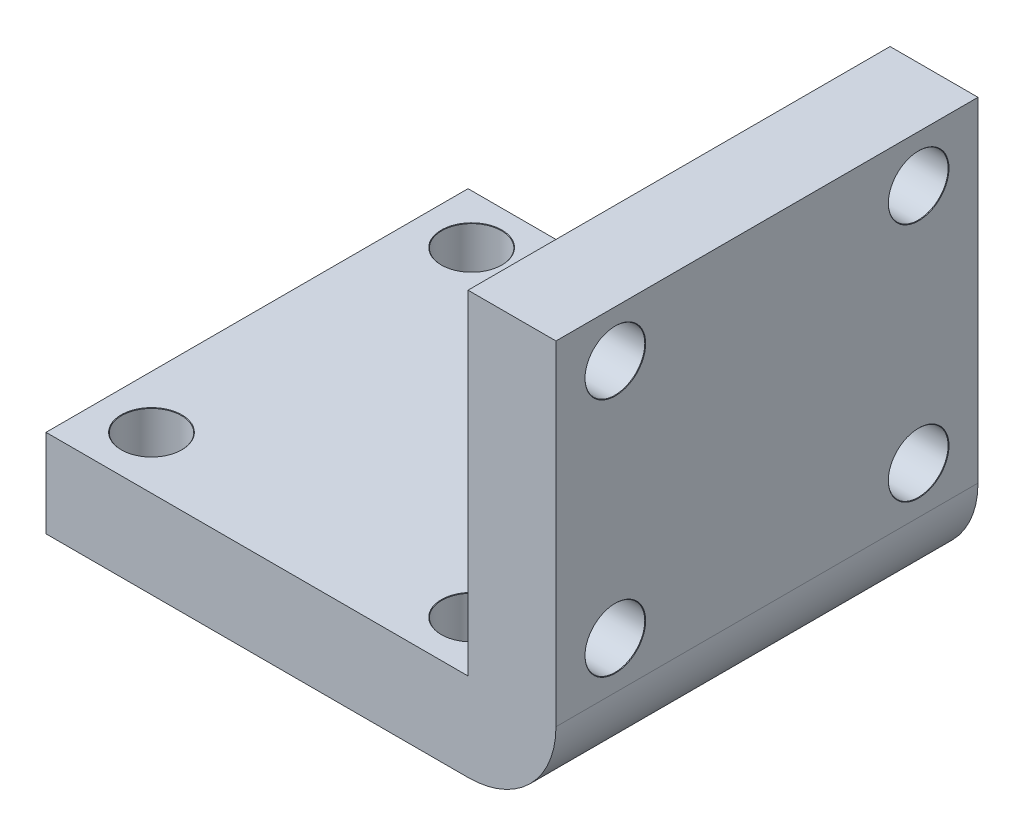
ISO-10303-21;
HEADER;
FILE_DESCRIPTION(('STEP AP214'),'2;1');
FILE_NAME('part.step','',(''),(''),'','','');
FILE_SCHEMA(('AUTOMOTIVE_DESIGN { 1 0 10303 214 1 1 1 1 }'));
ENDSEC;
DATA;
#1=APPLICATION_CONTEXT('core data for automotive mechanical design processes');
#2=APPLICATION_PROTOCOL_DEFINITION('international standard','automotive_design',2000,#1);
#3=PRODUCT_CONTEXT('',#1,'mechanical');
#4=PRODUCT('Part','Part','',(#3));
#5=PRODUCT_RELATED_PRODUCT_CATEGORY('part','',(#4));
#6=PRODUCT_DEFINITION_FORMATION('','',#4);
#7=PRODUCT_DEFINITION_CONTEXT('part definition',#1,'design');
#8=PRODUCT_DEFINITION('design','',#6,#7);
#9=PRODUCT_DEFINITION_SHAPE('','',#8);
#10=(LENGTH_UNIT() NAMED_UNIT(*) SI_UNIT(.MILLI.,.METRE.));
#11=(NAMED_UNIT(*) PLANE_ANGLE_UNIT() SI_UNIT($,.RADIAN.));
#12=(NAMED_UNIT(*) SI_UNIT($,.STERADIAN.) SOLID_ANGLE_UNIT());
#13=UNCERTAINTY_MEASURE_WITH_UNIT(LENGTH_MEASURE(1.E-05),#10,'distance_accuracy_value','');
#14=(GEOMETRIC_REPRESENTATION_CONTEXT(3) GLOBAL_UNCERTAINTY_ASSIGNED_CONTEXT((#13)) GLOBAL_UNIT_ASSIGNED_CONTEXT((#10,
#11,#12)) REPRESENTATION_CONTEXT('',''));
#15=CARTESIAN_POINT('',(0.,0.,0.));
#16=DIRECTION('',(0.,0.,1.));
#17=DIRECTION('',(1.,0.,0.));
#18=AXIS2_PLACEMENT_3D('',#15,#16,#17);
#19=CARTESIAN_POINT('',(-12.,5.,12.));
#20=DIRECTION('',(1.,0.,0.));
#21=DIRECTION('',(0.,0.,-1.));
#22=AXIS2_PLACEMENT_3D('',#19,#20,#21);
#23=PLANE('',#22);
#24=DIRECTION('',(0.,0.,1.));
#25=VECTOR('',#24,1.);
#26=CARTESIAN_POINT('',(-12.,0.,12.));
#27=LINE('',#26,#25);
#28=CARTESIAN_POINT('',(-12.,0.,-12.));
#29=VERTEX_POINT('',#28);
#30=CARTESIAN_POINT('',(-12.,0.,12.));
#31=VERTEX_POINT('',#30);
#32=EDGE_CURVE('E124',#29,#31,#27,.T.);
#33=ORIENTED_EDGE('',*,*,#32,.T.);
#34=DIRECTION('',(0.,-1.,0.));
#35=VECTOR('',#34,1.);
#36=CARTESIAN_POINT('',(-12.,5.,12.));
#37=LINE('',#36,#35);
#38=CARTESIAN_POINT('',(-12.,5.,12.));
#39=VERTEX_POINT('',#38);
#40=EDGE_CURVE('E174',#39,#31,#37,.T.);
#41=ORIENTED_EDGE('',*,*,#40,.F.);
#42=DIRECTION('',(0.,0.,1.));
#43=VECTOR('',#42,1.);
#44=CARTESIAN_POINT('',(-12.,5.,12.));
#45=LINE('',#44,#43);
#46=CARTESIAN_POINT('',(-12.,5.,-12.));
#47=VERTEX_POINT('',#46);
#48=EDGE_CURVE('E146',#47,#39,#45,.T.);
#49=ORIENTED_EDGE('',*,*,#48,.F.);
#50=DIRECTION('',(0.,-1.,0.));
#51=VECTOR('',#50,1.);
#52=CARTESIAN_POINT('',(-12.,5.,-12.));
#53=LINE('',#52,#51);
#54=EDGE_CURVE('E162',#47,#29,#53,.T.);
#55=ORIENTED_EDGE('',*,*,#54,.T.);
#56=EDGE_LOOP('',(#33,#41,#49,#55));
#57=FACE_BOUND('',#56,.T.);
#58=ADVANCED_FACE('F45',(#57),#23,.F.);
#59=CARTESIAN_POINT('',(12.,5.,12.));
#60=DIRECTION('',(0.,0.,-1.));
#61=DIRECTION('',(-1.,0.,0.));
#62=AXIS2_PLACEMENT_3D('',#59,#60,#61);
#63=PLANE('',#62);
#64=DIRECTION('',(1.,0.,0.));
#65=VECTOR('',#64,1.);
#66=CARTESIAN_POINT('',(12.,0.,12.));
#67=LINE('',#66,#65);
#68=CARTESIAN_POINT('',(12.,0.,12.));
#69=VERTEX_POINT('',#68);
#70=EDGE_CURVE('E166',#31,#69,#67,.T.);
#71=ORIENTED_EDGE('',*,*,#70,.T.);
#72=CARTESIAN_POINT('',(12.,5.,12.));
#73=DIRECTION('',(0.,0.,-1.));
#74=DIRECTION('',(-1.,0.,0.));
#75=AXIS2_PLACEMENT_3D('',#72,#73,#74);
#76=CIRCLE('',#75,5.);
#77=CARTESIAN_POINT('',(17.,5.,12.));
#78=VERTEX_POINT('',#77);
#79=EDGE_CURVE('E11',#69,#78,#76,.F.);
#80=ORIENTED_EDGE('',*,*,#79,.T.);
#81=DIRECTION('',(0.,-1.,0.));
#82=VECTOR('',#81,1.);
#83=CARTESIAN_POINT('',(17.,5.,12.));
#84=LINE('',#83,#82);
#85=CARTESIAN_POINT('',(17.,24.,12.));
#86=VERTEX_POINT('',#85);
#87=EDGE_CURVE('E114',#86,#78,#84,.T.);
#88=ORIENTED_EDGE('',*,*,#87,.F.);
#89=DIRECTION('',(-1.,0.,0.));
#90=VECTOR('',#89,1.);
#91=CARTESIAN_POINT('',(17.,24.,12.));
#92=LINE('',#91,#90);
#93=CARTESIAN_POINT('',(12.,24.,12.));
#94=VERTEX_POINT('',#93);
#95=EDGE_CURVE('E125',#86,#94,#92,.T.);
#96=ORIENTED_EDGE('',*,*,#95,.T.);
#97=DIRECTION('',(0.,-1.,0.));
#98=VECTOR('',#97,1.);
#99=CARTESIAN_POINT('',(12.,5.,12.));
#100=LINE('',#99,#98);
#101=CARTESIAN_POINT('',(12.,5.,12.));
#102=VERTEX_POINT('',#101);
#103=EDGE_CURVE('E136',#94,#102,#100,.T.);
#104=ORIENTED_EDGE('',*,*,#103,.T.);
#105=DIRECTION('',(1.,0.,0.));
#106=VECTOR('',#105,1.);
#107=CARTESIAN_POINT('',(12.,5.,12.));
#108=LINE('',#107,#106);
#109=EDGE_CURVE('E150',#39,#102,#108,.T.);
#110=ORIENTED_EDGE('',*,*,#109,.F.);
#111=ORIENTED_EDGE('',*,*,#40,.T.);
#112=EDGE_LOOP('',(#71,#80,#88,#96,#104,#110,#111));
#113=FACE_BOUND('',#112,.T.);
#114=ADVANCED_FACE('F226',(#113),#63,.F.);
#115=CARTESIAN_POINT('',(12.,5.,-12.));
#116=DIRECTION('',(0.,0.,1.));
#117=DIRECTION('',(1.,0.,0.));
#118=AXIS2_PLACEMENT_3D('',#115,#116,#117);
#119=PLANE('',#118);
#120=DIRECTION('',(0.,1.,0.));
#121=VECTOR('',#120,1.);
#122=CARTESIAN_POINT('',(17.,5.,-12.));
#123=LINE('',#122,#121);
#124=CARTESIAN_POINT('',(17.,5.,-12.));
#125=VERTEX_POINT('',#124);
#126=CARTESIAN_POINT('',(17.,24.,-12.));
#127=VERTEX_POINT('',#126);
#128=EDGE_CURVE('E104',#125,#127,#123,.T.);
#129=ORIENTED_EDGE('',*,*,#128,.F.);
#130=CARTESIAN_POINT('',(12.,5.,-12.));
#131=DIRECTION('',(0.,0.,1.));
#132=DIRECTION('',(1.,0.,0.));
#133=AXIS2_PLACEMENT_3D('',#130,#131,#132);
#134=CIRCLE('',#133,5.);
#135=CARTESIAN_POINT('',(12.,0.,-12.));
#136=VERTEX_POINT('',#135);
#137=EDGE_CURVE('E70',#125,#136,#134,.F.);
#138=ORIENTED_EDGE('',*,*,#137,.T.);
#139=DIRECTION('',(-1.,0.,0.));
#140=VECTOR('',#139,1.);
#141=CARTESIAN_POINT('',(12.,0.,-12.));
#142=LINE('',#141,#140);
#143=EDGE_CURVE('E151',#136,#29,#142,.T.);
#144=ORIENTED_EDGE('',*,*,#143,.T.);
#145=ORIENTED_EDGE('',*,*,#54,.F.);
#146=DIRECTION('',(-1.,0.,0.));
#147=VECTOR('',#146,1.);
#148=CARTESIAN_POINT('',(12.,5.,-12.));
#149=LINE('',#148,#147);
#150=CARTESIAN_POINT('',(12.,5.,-12.));
#151=VERTEX_POINT('',#150);
#152=EDGE_CURVE('E159',#151,#47,#149,.T.);
#153=ORIENTED_EDGE('',*,*,#152,.F.);
#154=DIRECTION('',(0.,1.,0.));
#155=VECTOR('',#154,1.);
#156=CARTESIAN_POINT('',(12.,5.,-12.));
#157=LINE('',#156,#155);
#158=CARTESIAN_POINT('',(12.,24.,-12.));
#159=VERTEX_POINT('',#158);
#160=EDGE_CURVE('E120',#151,#159,#157,.T.);
#161=ORIENTED_EDGE('',*,*,#160,.T.);
#162=DIRECTION('',(-1.,0.,0.));
#163=VECTOR('',#162,1.);
#164=CARTESIAN_POINT('',(17.,24.,-12.));
#165=LINE('',#164,#163);
#166=EDGE_CURVE('E117',#127,#159,#165,.T.);
#167=ORIENTED_EDGE('',*,*,#166,.F.);
#168=EDGE_LOOP('',(#129,#138,#144,#145,#153,#161,#167));
#169=FACE_BOUND('',#168,.T.);
#170=ADVANCED_FACE('F118',(#169),#119,.F.);
#171=CARTESIAN_POINT('',(0.,5.,0.));
#172=DIRECTION('',(0.,1.,0.));
#173=DIRECTION('',(0.,0.,1.));
#174=AXIS2_PLACEMENT_3D('',#171,#172,#173);
#175=PLANE('',#174);
#176=CARTESIAN_POINT('',(-9.,5.,8.99999999999999));
#177=DIRECTION('',(0.,1.,0.));
#178=DIRECTION('',(0.,0.,1.));
#179=AXIS2_PLACEMENT_3D('',#176,#177,#178);
#180=CIRCLE('',#179,1.725);
#181=CARTESIAN_POINT('',(-9.,5.,10.725));
#182=VERTEX_POINT('',#181);
#183=EDGE_CURVE('E587',#182,#182,#180,.T.);
#184=ORIENTED_EDGE('',*,*,#183,.F.);
#185=EDGE_LOOP('',(#184));
#186=FACE_BOUND('',#185,.T.);
#187=CARTESIAN_POINT('',(-9.,5.,-9.20365469850911));
#188=DIRECTION('',(0.,1.,0.));
#189=DIRECTION('',(0.,0.,1.));
#190=AXIS2_PLACEMENT_3D('',#187,#188,#189);
#191=CIRCLE('',#190,1.725);
#192=CARTESIAN_POINT('',(-9.,5.,-7.47865469850911));
#193=VERTEX_POINT('',#192);
#194=EDGE_CURVE('E597',#193,#193,#191,.T.);
#195=ORIENTED_EDGE('',*,*,#194,.F.);
#196=EDGE_LOOP('',(#195));
#197=FACE_BOUND('',#196,.T.);
#198=CARTESIAN_POINT('',(9.2036546985091,5.,-9.20365469850911));
#199=DIRECTION('',(0.,1.,0.));
#200=DIRECTION('',(0.,0.,1.));
#201=AXIS2_PLACEMENT_3D('',#198,#199,#200);
#202=CIRCLE('',#201,1.725);
#203=CARTESIAN_POINT('',(9.2036546985091,5.,-7.47865469850911));
#204=VERTEX_POINT('',#203);
#205=EDGE_CURVE('E609',#204,#204,#202,.T.);
#206=ORIENTED_EDGE('',*,*,#205,.F.);
#207=EDGE_LOOP('',(#206));
#208=FACE_BOUND('',#207,.T.);
#209=CARTESIAN_POINT('',(9.2036546985091,5.,8.99999999999999));
#210=DIRECTION('',(0.,1.,0.));
#211=DIRECTION('',(0.,0.,1.));
#212=AXIS2_PLACEMENT_3D('',#209,#210,#211);
#213=CIRCLE('',#212,1.725);
#214=CARTESIAN_POINT('',(9.2036546985091,5.,10.725));
#215=VERTEX_POINT('',#214);
#216=EDGE_CURVE('E621',#215,#215,#213,.T.);
#217=ORIENTED_EDGE('',*,*,#216,.F.);
#218=EDGE_LOOP('',(#217));
#219=FACE_BOUND('',#218,.T.);
#220=ORIENTED_EDGE('',*,*,#48,.T.);
#221=ORIENTED_EDGE('',*,*,#109,.T.);
#222=DIRECTION('',(0.,0.,-1.));
#223=VECTOR('',#222,1.);
#224=CARTESIAN_POINT('',(12.,5.,12.));
#225=LINE('',#224,#223);
#226=EDGE_CURVE('E155',#102,#151,#225,.T.);
#227=ORIENTED_EDGE('',*,*,#226,.T.);
#228=ORIENTED_EDGE('',*,*,#152,.T.);
#229=EDGE_LOOP('',(#220,#221,#227,#228));
#230=FACE_BOUND('',#229,.T.);
#231=ADVANCED_FACE('F234',(#186,#197,#208,#219,#230),#175,.T.);
#232=CARTESIAN_POINT('',(0.,0.,0.));
#233=DIRECTION('',(0.,1.,0.));
#234=DIRECTION('',(0.,0.,1.));
#235=AXIS2_PLACEMENT_3D('',#232,#233,#234);
#236=PLANE('',#235);
#237=CARTESIAN_POINT('',(-9.,0.,8.99999999999999));
#238=DIRECTION('',(0.,1.,0.));
#239=DIRECTION('',(0.,0.,1.));
#240=AXIS2_PLACEMENT_3D('',#237,#238,#239);
#241=CIRCLE('',#240,1.69999999999999);
#242=CARTESIAN_POINT('',(-9.,0.,10.7));
#243=VERTEX_POINT('',#242);
#244=EDGE_CURVE('E591',#243,#243,#241,.T.);
#245=ORIENTED_EDGE('',*,*,#244,.T.);
#246=EDGE_LOOP('',(#245));
#247=FACE_BOUND('',#246,.T.);
#248=CARTESIAN_POINT('',(-9.,0.,-9.20365469850911));
#249=DIRECTION('',(0.,1.,0.));
#250=DIRECTION('',(0.,0.,1.));
#251=AXIS2_PLACEMENT_3D('',#248,#249,#250);
#252=CIRCLE('',#251,1.69999999999999);
#253=CARTESIAN_POINT('',(-9.,0.,-7.50365469850912));
#254=VERTEX_POINT('',#253);
#255=EDGE_CURVE('E605',#254,#254,#252,.T.);
#256=ORIENTED_EDGE('',*,*,#255,.T.);
#257=EDGE_LOOP('',(#256));
#258=FACE_BOUND('',#257,.T.);
#259=CARTESIAN_POINT('',(9.2036546985091,0.,-9.20365469850911));
#260=DIRECTION('',(0.,1.,0.));
#261=DIRECTION('',(0.,0.,1.));
#262=AXIS2_PLACEMENT_3D('',#259,#260,#261);
#263=CIRCLE('',#262,1.69999999999999);
#264=CARTESIAN_POINT('',(9.2036546985091,0.,-7.50365469850912));
#265=VERTEX_POINT('',#264);
#266=EDGE_CURVE('E617',#265,#265,#263,.T.);
#267=ORIENTED_EDGE('',*,*,#266,.T.);
#268=EDGE_LOOP('',(#267));
#269=FACE_BOUND('',#268,.T.);
#270=CARTESIAN_POINT('',(9.2036546985091,0.,8.99999999999999));
#271=DIRECTION('',(0.,1.,0.));
#272=DIRECTION('',(0.,0.,1.));
#273=AXIS2_PLACEMENT_3D('',#270,#271,#272);
#274=CIRCLE('',#273,1.69999999999999);
#275=CARTESIAN_POINT('',(9.2036546985091,0.,10.7));
#276=VERTEX_POINT('',#275);
#277=EDGE_CURVE('E629',#276,#276,#274,.T.);
#278=ORIENTED_EDGE('',*,*,#277,.T.);
#279=EDGE_LOOP('',(#278));
#280=FACE_BOUND('',#279,.T.);
#281=ORIENTED_EDGE('',*,*,#143,.F.);
#282=DIRECTION('',(0.,0.,-1.));
#283=VECTOR('',#282,1.);
#284=CARTESIAN_POINT('',(12.,0.,12.));
#285=LINE('',#284,#283);
#286=EDGE_CURVE('E55',#136,#69,#285,.F.);
#287=ORIENTED_EDGE('',*,*,#286,.T.);
#288=ORIENTED_EDGE('',*,*,#70,.F.);
#289=ORIENTED_EDGE('',*,*,#32,.F.);
#290=EDGE_LOOP('',(#281,#287,#288,#289));
#291=FACE_BOUND('',#290,.T.);
#292=ADVANCED_FACE('F229',(#247,#258,#269,#280,#291),#236,.F.);
#293=CARTESIAN_POINT('',(17.,24.,12.));
#294=DIRECTION('',(0.,-1.,0.));
#295=DIRECTION('',(0.,0.,-1.));
#296=AXIS2_PLACEMENT_3D('',#293,#294,#295);
#297=PLANE('',#296);
#298=DIRECTION('',(0.,0.,1.));
#299=VECTOR('',#298,1.);
#300=CARTESIAN_POINT('',(12.,24.,12.));
#301=LINE('',#300,#299);
#302=EDGE_CURVE('E143',#159,#94,#301,.T.);
#303=ORIENTED_EDGE('',*,*,#302,.T.);
#304=ORIENTED_EDGE('',*,*,#95,.F.);
#305=DIRECTION('',(0.,0.,1.));
#306=VECTOR('',#305,1.);
#307=CARTESIAN_POINT('',(17.,24.,12.));
#308=LINE('',#307,#306);
#309=EDGE_CURVE('E109',#127,#86,#308,.T.);
#310=ORIENTED_EDGE('',*,*,#309,.F.);
#311=ORIENTED_EDGE('',*,*,#166,.T.);
#312=EDGE_LOOP('',(#303,#304,#310,#311));
#313=FACE_BOUND('',#312,.T.);
#314=ADVANCED_FACE('F127',(#313),#297,.F.);
#315=CARTESIAN_POINT('',(17.,0.,0.));
#316=DIRECTION('',(1.,0.,0.));
#317=DIRECTION('',(0.,0.,-1.));
#318=AXIS2_PLACEMENT_3D('',#315,#316,#317);
#319=PLANE('',#318);
#320=CARTESIAN_POINT('',(17.,21.3277323880212,8.62450406907938));
#321=DIRECTION('',(1.,0.,0.));
#322=DIRECTION('',(0.,0.,-1.));
#323=AXIS2_PLACEMENT_3D('',#320,#321,#322);
#324=CIRCLE('',#323,1.725);
#325=CARTESIAN_POINT('',(17.,21.3277323880212,6.89950406907938));
#326=VERTEX_POINT('',#325);
#327=EDGE_CURVE('E633',#326,#326,#324,.T.);
#328=ORIENTED_EDGE('',*,*,#327,.F.);
#329=EDGE_LOOP('',(#328));
#330=FACE_BOUND('',#329,.T.);
#331=CARTESIAN_POINT('',(17.,21.3277323880212,-8.62450406907937));
#332=DIRECTION('',(1.,0.,0.));
#333=DIRECTION('',(0.,0.,-1.));
#334=AXIS2_PLACEMENT_3D('',#331,#332,#333);
#335=CIRCLE('',#334,1.725);
#336=CARTESIAN_POINT('',(17.,21.3277323880212,-10.3495040690794));
#337=VERTEX_POINT('',#336);
#338=EDGE_CURVE('E205',#337,#337,#335,.T.);
#339=ORIENTED_EDGE('',*,*,#338,.F.);
#340=EDGE_LOOP('',(#339));
#341=FACE_BOUND('',#340,.T.);
#342=CARTESIAN_POINT('',(17.,7.67226761197883,-8.62450406907937));
#343=DIRECTION('',(1.,0.,0.));
#344=DIRECTION('',(0.,0.,-1.));
#345=AXIS2_PLACEMENT_3D('',#342,#343,#344);
#346=CIRCLE('',#345,1.725);
#347=CARTESIAN_POINT('',(17.,7.67226761197883,-10.3495040690794));
#348=VERTEX_POINT('',#347);
#349=EDGE_CURVE('E196',#348,#348,#346,.T.);
#350=ORIENTED_EDGE('',*,*,#349,.F.);
#351=EDGE_LOOP('',(#350));
#352=FACE_BOUND('',#351,.T.);
#353=CARTESIAN_POINT('',(17.,7.67226761197883,8.62450406907938));
#354=DIRECTION('',(1.,0.,0.));
#355=DIRECTION('',(0.,0.,-1.));
#356=AXIS2_PLACEMENT_3D('',#353,#354,#355);
#357=CIRCLE('',#356,1.725);
#358=CARTESIAN_POINT('',(17.,7.67226761197883,6.89950406907938));
#359=VERTEX_POINT('',#358);
#360=EDGE_CURVE('E191',#359,#359,#357,.T.);
#361=ORIENTED_EDGE('',*,*,#360,.F.);
#362=EDGE_LOOP('',(#361));
#363=FACE_BOUND('',#362,.T.);
#364=ORIENTED_EDGE('',*,*,#87,.T.);
#365=DIRECTION('',(0.,0.,-1.));
#366=VECTOR('',#365,1.);
#367=CARTESIAN_POINT('',(17.,5.,-12.));
#368=LINE('',#367,#366);
#369=EDGE_CURVE('E112',#78,#125,#368,.T.);
#370=ORIENTED_EDGE('',*,*,#369,.T.);
#371=ORIENTED_EDGE('',*,*,#128,.T.);
#372=ORIENTED_EDGE('',*,*,#309,.T.);
#373=EDGE_LOOP('',(#364,#370,#371,#372));
#374=FACE_BOUND('',#373,.T.);
#375=ADVANCED_FACE('F107',(#330,#341,#352,#363,#374),#319,.T.);
#376=CARTESIAN_POINT('',(12.,0.,0.));
#377=DIRECTION('',(1.,0.,0.));
#378=DIRECTION('',(0.,0.,-1.));
#379=AXIS2_PLACEMENT_3D('',#376,#377,#378);
#380=PLANE('',#379);
#381=CARTESIAN_POINT('',(12.,21.3277323880212,8.62450406907938));
#382=DIRECTION('',(1.,0.,0.));
#383=DIRECTION('',(0.,0.,-1.));
#384=AXIS2_PLACEMENT_3D('',#381,#382,#383);
#385=CIRCLE('',#384,1.69999999999999);
#386=CARTESIAN_POINT('',(12.,21.3277323880212,6.92450406907939));
#387=VERTEX_POINT('',#386);
#388=EDGE_CURVE('E49',#387,#387,#385,.T.);
#389=ORIENTED_EDGE('',*,*,#388,.T.);
#390=EDGE_LOOP('',(#389));
#391=FACE_BOUND('',#390,.T.);
#392=CARTESIAN_POINT('',(12.,21.3277323880212,-8.62450406907937));
#393=DIRECTION('',(1.,0.,0.));
#394=DIRECTION('',(0.,0.,-1.));
#395=AXIS2_PLACEMENT_3D('',#392,#393,#394);
#396=CIRCLE('',#395,1.69999999999999);
#397=CARTESIAN_POINT('',(12.,21.3277323880212,-10.3245040690794));
#398=VERTEX_POINT('',#397);
#399=EDGE_CURVE('E193',#398,#398,#396,.T.);
#400=ORIENTED_EDGE('',*,*,#399,.T.);
#401=EDGE_LOOP('',(#400));
#402=FACE_BOUND('',#401,.T.);
#403=CARTESIAN_POINT('',(12.,7.67226761197883,-8.62450406907937));
#404=DIRECTION('',(1.,0.,0.));
#405=DIRECTION('',(0.,0.,-1.));
#406=AXIS2_PLACEMENT_3D('',#403,#404,#405);
#407=CIRCLE('',#406,1.69999999999999);
#408=CARTESIAN_POINT('',(12.,7.67226761197883,-10.3245040690794));
#409=VERTEX_POINT('',#408);
#410=EDGE_CURVE('E188',#409,#409,#407,.T.);
#411=ORIENTED_EDGE('',*,*,#410,.T.);
#412=EDGE_LOOP('',(#411));
#413=FACE_BOUND('',#412,.T.);
#414=CARTESIAN_POINT('',(12.,7.67226761197883,8.62450406907938));
#415=DIRECTION('',(1.,0.,0.));
#416=DIRECTION('',(0.,0.,-1.));
#417=AXIS2_PLACEMENT_3D('',#414,#415,#416);
#418=CIRCLE('',#417,1.69999999999999);
#419=CARTESIAN_POINT('',(12.,7.67226761197883,6.92450406907939));
#420=VERTEX_POINT('',#419);
#421=EDGE_CURVE('E140',#420,#420,#418,.T.);
#422=ORIENTED_EDGE('',*,*,#421,.T.);
#423=EDGE_LOOP('',(#422));
#424=FACE_BOUND('',#423,.T.);
#425=ORIENTED_EDGE('',*,*,#226,.F.);
#426=ORIENTED_EDGE('',*,*,#103,.F.);
#427=ORIENTED_EDGE('',*,*,#302,.F.);
#428=ORIENTED_EDGE('',*,*,#160,.F.);
#429=EDGE_LOOP('',(#425,#426,#427,#428));
#430=FACE_BOUND('',#429,.T.);
#431=ADVANCED_FACE('F237',(#391,#402,#413,#424,#430),#380,.F.);
#432=CARTESIAN_POINT('',(12.,5.,0.));
#433=DIRECTION('',(0.,0.,1.));
#434=DIRECTION('',(1.,0.,0.));
#435=AXIS2_PLACEMENT_3D('',#432,#433,#434);
#436=CYLINDRICAL_SURFACE('',#435,5.);
#437=ORIENTED_EDGE('',*,*,#79,.F.);
#438=ORIENTED_EDGE('',*,*,#286,.F.);
#439=ORIENTED_EDGE('',*,*,#137,.F.);
#440=ORIENTED_EDGE('',*,*,#369,.F.);
#441=EDGE_LOOP('',(#437,#438,#439,#440));
#442=FACE_BOUND('',#441,.T.);
#443=ADVANCED_FACE('F47',(#442),#436,.T.);
#444=CARTESIAN_POINT('',(17.,7.67226761197883,8.62450406907938));
#445=DIRECTION('',(1.,0.,0.));
#446=DIRECTION('',(0.,0.,-1.));
#447=AXIS2_PLACEMENT_3D('',#444,#445,#446);
#448=CYLINDRICAL_SURFACE('',#447,1.69999999999999);
#449=CARTESIAN_POINT('',(16.975,7.67226761197883,8.62450406907938));
#450=DIRECTION('',(1.,0.,0.));
#451=DIRECTION('',(0.,0.,-1.));
#452=AXIS2_PLACEMENT_3D('',#449,#450,#451);
#453=CIRCLE('',#452,1.69999999999999);
#454=CARTESIAN_POINT('',(16.975,7.67226761197883,6.92450406907939));
#455=VERTEX_POINT('',#454);
#456=EDGE_CURVE('E187',#455,#455,#453,.T.);
#457=ORIENTED_EDGE('',*,*,#456,.T.);
#458=EDGE_LOOP('',(#457));
#459=FACE_BOUND('',#458,.T.);
#460=ORIENTED_EDGE('',*,*,#421,.F.);
#461=EDGE_LOOP('',(#460));
#462=FACE_BOUND('',#461,.T.);
#463=ADVANCED_FACE('F245',(#459,#462),#448,.F.);
#464=CARTESIAN_POINT('',(17.,7.67226761197883,8.62450406907938));
#465=DIRECTION('',(1.,0.,0.));
#466=DIRECTION('',(0.,0.,-1.));
#467=AXIS2_PLACEMENT_3D('',#464,#465,#466);
#468=CONICAL_SURFACE('',#467,1.725,0.785398163397518);
#469=ORIENTED_EDGE('',*,*,#456,.F.);
#470=EDGE_LOOP('',(#469));
#471=FACE_BOUND('',#470,.T.);
#472=ORIENTED_EDGE('',*,*,#360,.T.);
#473=EDGE_LOOP('',(#472));
#474=FACE_BOUND('',#473,.T.);
#475=ADVANCED_FACE('F292',(#471,#474),#468,.F.);
#476=CARTESIAN_POINT('',(17.,7.67226761197883,-8.62450406907937));
#477=DIRECTION('',(1.,0.,0.));
#478=DIRECTION('',(0.,0.,-1.));
#479=AXIS2_PLACEMENT_3D('',#476,#477,#478);
#480=CYLINDRICAL_SURFACE('',#479,1.69999999999999);
#481=CARTESIAN_POINT('',(16.975,7.67226761197883,-8.62450406907937));
#482=DIRECTION('',(1.,0.,0.));
#483=DIRECTION('',(0.,0.,-1.));
#484=AXIS2_PLACEMENT_3D('',#481,#482,#483);
#485=CIRCLE('',#484,1.69999999999999);
#486=CARTESIAN_POINT('',(16.975,7.67226761197883,-10.3245040690794));
#487=VERTEX_POINT('',#486);
#488=EDGE_CURVE('E192',#487,#487,#485,.T.);
#489=ORIENTED_EDGE('',*,*,#488,.T.);
#490=EDGE_LOOP('',(#489));
#491=FACE_BOUND('',#490,.T.);
#492=ORIENTED_EDGE('',*,*,#410,.F.);
#493=EDGE_LOOP('',(#492));
#494=FACE_BOUND('',#493,.T.);
#495=ADVANCED_FACE('F302',(#491,#494),#480,.F.);
#496=CARTESIAN_POINT('',(17.,7.67226761197883,-8.62450406907937));
#497=DIRECTION('',(1.,0.,0.));
#498=DIRECTION('',(0.,0.,-1.));
#499=AXIS2_PLACEMENT_3D('',#496,#497,#498);
#500=CONICAL_SURFACE('',#499,1.725,0.785398163397518);
#501=ORIENTED_EDGE('',*,*,#488,.F.);
#502=EDGE_LOOP('',(#501));
#503=FACE_BOUND('',#502,.T.);
#504=ORIENTED_EDGE('',*,*,#349,.T.);
#505=EDGE_LOOP('',(#504));
#506=FACE_BOUND('',#505,.T.);
#507=ADVANCED_FACE('F312',(#503,#506),#500,.F.);
#508=CARTESIAN_POINT('',(17.,21.3277323880212,-8.62450406907937));
#509=DIRECTION('',(1.,0.,0.));
#510=DIRECTION('',(0.,0.,-1.));
#511=AXIS2_PLACEMENT_3D('',#508,#509,#510);
#512=CYLINDRICAL_SURFACE('',#511,1.69999999999999);
#513=CARTESIAN_POINT('',(16.975,21.3277323880212,-8.62450406907937));
#514=DIRECTION('',(1.,0.,0.));
#515=DIRECTION('',(0.,0.,-1.));
#516=AXIS2_PLACEMENT_3D('',#513,#514,#515);
#517=CIRCLE('',#516,1.69999999999999);
#518=CARTESIAN_POINT('',(16.975,21.3277323880212,-10.3245040690794));
#519=VERTEX_POINT('',#518);
#520=EDGE_CURVE('E197',#519,#519,#517,.T.);
#521=ORIENTED_EDGE('',*,*,#520,.T.);
#522=EDGE_LOOP('',(#521));
#523=FACE_BOUND('',#522,.T.);
#524=ORIENTED_EDGE('',*,*,#399,.F.);
#525=EDGE_LOOP('',(#524));
#526=FACE_BOUND('',#525,.T.);
#527=ADVANCED_FACE('F322',(#523,#526),#512,.F.);
#528=CARTESIAN_POINT('',(17.,21.3277323880212,-8.62450406907937));
#529=DIRECTION('',(1.,0.,0.));
#530=DIRECTION('',(0.,0.,-1.));
#531=AXIS2_PLACEMENT_3D('',#528,#529,#530);
#532=CONICAL_SURFACE('',#531,1.725,0.785398163397518);
#533=ORIENTED_EDGE('',*,*,#520,.F.);
#534=EDGE_LOOP('',(#533));
#535=FACE_BOUND('',#534,.T.);
#536=ORIENTED_EDGE('',*,*,#338,.T.);
#537=EDGE_LOOP('',(#536));
#538=FACE_BOUND('',#537,.T.);
#539=ADVANCED_FACE('F332',(#535,#538),#532,.F.);
#540=CARTESIAN_POINT('',(17.,21.3277323880212,8.62450406907938));
#541=DIRECTION('',(1.,0.,0.));
#542=DIRECTION('',(0.,0.,-1.));
#543=AXIS2_PLACEMENT_3D('',#540,#541,#542);
#544=CYLINDRICAL_SURFACE('',#543,1.69999999999999);
#545=CARTESIAN_POINT('',(16.975,21.3277323880212,8.62450406907938));
#546=DIRECTION('',(1.,0.,0.));
#547=DIRECTION('',(0.,0.,-1.));
#548=AXIS2_PLACEMENT_3D('',#545,#546,#547);
#549=CIRCLE('',#548,1.69999999999999);
#550=CARTESIAN_POINT('',(16.975,21.3277323880212,6.92450406907939));
#551=VERTEX_POINT('',#550);
#552=EDGE_CURVE('E636',#551,#551,#549,.T.);
#553=ORIENTED_EDGE('',*,*,#552,.T.);
#554=EDGE_LOOP('',(#553));
#555=FACE_BOUND('',#554,.T.);
#556=ORIENTED_EDGE('',*,*,#388,.F.);
#557=EDGE_LOOP('',(#556));
#558=FACE_BOUND('',#557,.T.);
#559=ADVANCED_FACE('F341',(#555,#558),#544,.F.);
#560=CARTESIAN_POINT('',(17.,21.3277323880212,8.62450406907938));
#561=DIRECTION('',(1.,0.,0.));
#562=DIRECTION('',(0.,0.,-1.));
#563=AXIS2_PLACEMENT_3D('',#560,#561,#562);
#564=CONICAL_SURFACE('',#563,1.725,0.785398163397518);
#565=ORIENTED_EDGE('',*,*,#552,.F.);
#566=EDGE_LOOP('',(#565));
#567=FACE_BOUND('',#566,.T.);
#568=ORIENTED_EDGE('',*,*,#327,.T.);
#569=EDGE_LOOP('',(#568));
#570=FACE_BOUND('',#569,.T.);
#571=ADVANCED_FACE('F351',(#567,#570),#564,.F.);
#572=CARTESIAN_POINT('',(9.2036546985091,5.,8.99999999999999));
#573=DIRECTION('',(0.,1.,0.));
#574=DIRECTION('',(0.,0.,1.));
#575=AXIS2_PLACEMENT_3D('',#572,#573,#574);
#576=CYLINDRICAL_SURFACE('',#575,1.69999999999999);
#577=ORIENTED_EDGE('',*,*,#277,.F.);
#578=EDGE_LOOP('',(#577));
#579=FACE_BOUND('',#578,.T.);
#580=CARTESIAN_POINT('',(9.2036546985091,4.97499999999997,8.99999999999999));
#581=DIRECTION('',(0.,1.,0.));
#582=DIRECTION('',(0.,0.,1.));
#583=AXIS2_PLACEMENT_3D('',#580,#581,#582);
#584=CIRCLE('',#583,1.69999999999999);
#585=CARTESIAN_POINT('',(9.2036546985091,4.97499999999997,10.7));
#586=VERTEX_POINT('',#585);
#587=EDGE_CURVE('E625',#586,#586,#584,.T.);
#588=ORIENTED_EDGE('',*,*,#587,.T.);
#589=EDGE_LOOP('',(#588));
#590=FACE_BOUND('',#589,.T.);
#591=ADVANCED_FACE('F361',(#579,#590),#576,.F.);
#592=CARTESIAN_POINT('',(9.2036546985091,5.,8.99999999999999));
#593=DIRECTION('',(0.,1.,0.));
#594=DIRECTION('',(0.,0.,1.));
#595=AXIS2_PLACEMENT_3D('',#592,#593,#594);
#596=CONICAL_SURFACE('',#595,1.725,0.785398163397171);
#597=ORIENTED_EDGE('',*,*,#587,.F.);
#598=EDGE_LOOP('',(#597));
#599=FACE_BOUND('',#598,.T.);
#600=ORIENTED_EDGE('',*,*,#216,.T.);
#601=EDGE_LOOP('',(#600));
#602=FACE_BOUND('',#601,.T.);
#603=ADVANCED_FACE('F372',(#599,#602),#596,.F.);
#604=CARTESIAN_POINT('',(9.2036546985091,5.,-9.20365469850911));
#605=DIRECTION('',(0.,1.,0.));
#606=DIRECTION('',(0.,0.,1.));
#607=AXIS2_PLACEMENT_3D('',#604,#605,#606);
#608=CYLINDRICAL_SURFACE('',#607,1.69999999999999);
#609=ORIENTED_EDGE('',*,*,#266,.F.);
#610=EDGE_LOOP('',(#609));
#611=FACE_BOUND('',#610,.T.);
#612=CARTESIAN_POINT('',(9.2036546985091,4.97499999999997,-9.20365469850911));
#613=DIRECTION('',(0.,1.,0.));
#614=DIRECTION('',(0.,0.,1.));
#615=AXIS2_PLACEMENT_3D('',#612,#613,#614);
#616=CIRCLE('',#615,1.69999999999999);
#617=CARTESIAN_POINT('',(9.2036546985091,4.97499999999997,-7.50365469850912));
#618=VERTEX_POINT('',#617);
#619=EDGE_CURVE('E613',#618,#618,#616,.T.);
#620=ORIENTED_EDGE('',*,*,#619,.T.);
#621=EDGE_LOOP('',(#620));
#622=FACE_BOUND('',#621,.T.);
#623=ADVANCED_FACE('F383',(#611,#622),#608,.F.);
#624=CARTESIAN_POINT('',(9.2036546985091,5.,-9.20365469850911));
#625=DIRECTION('',(0.,1.,0.));
#626=DIRECTION('',(0.,0.,1.));
#627=AXIS2_PLACEMENT_3D('',#624,#625,#626);
#628=CONICAL_SURFACE('',#627,1.725,0.785398163397171);
#629=ORIENTED_EDGE('',*,*,#619,.F.);
#630=EDGE_LOOP('',(#629));
#631=FACE_BOUND('',#630,.T.);
#632=ORIENTED_EDGE('',*,*,#205,.T.);
#633=EDGE_LOOP('',(#632));
#634=FACE_BOUND('',#633,.T.);
#635=ADVANCED_FACE('F393',(#631,#634),#628,.F.);
#636=CARTESIAN_POINT('',(-9.,5.,-9.20365469850911));
#637=DIRECTION('',(0.,1.,0.));
#638=DIRECTION('',(0.,0.,1.));
#639=AXIS2_PLACEMENT_3D('',#636,#637,#638);
#640=CYLINDRICAL_SURFACE('',#639,1.69999999999999);
#641=ORIENTED_EDGE('',*,*,#255,.F.);
#642=EDGE_LOOP('',(#641));
#643=FACE_BOUND('',#642,.T.);
#644=CARTESIAN_POINT('',(-9.,4.97499999999997,-9.20365469850911));
#645=DIRECTION('',(0.,1.,0.));
#646=DIRECTION('',(0.,0.,1.));
#647=AXIS2_PLACEMENT_3D('',#644,#645,#646);
#648=CIRCLE('',#647,1.69999999999999);
#649=CARTESIAN_POINT('',(-9.,4.97499999999997,-7.50365469850912));
#650=VERTEX_POINT('',#649);
#651=EDGE_CURVE('E601',#650,#650,#648,.T.);
#652=ORIENTED_EDGE('',*,*,#651,.T.);
#653=EDGE_LOOP('',(#652));
#654=FACE_BOUND('',#653,.T.);
#655=ADVANCED_FACE('F403',(#643,#654),#640,.F.);
#656=CARTESIAN_POINT('',(-9.,5.,-9.20365469850911));
#657=DIRECTION('',(0.,1.,0.));
#658=DIRECTION('',(0.,0.,1.));
#659=AXIS2_PLACEMENT_3D('',#656,#657,#658);
#660=CONICAL_SURFACE('',#659,1.725,0.785398163397171);
#661=ORIENTED_EDGE('',*,*,#651,.F.);
#662=EDGE_LOOP('',(#661));
#663=FACE_BOUND('',#662,.T.);
#664=ORIENTED_EDGE('',*,*,#194,.T.);
#665=EDGE_LOOP('',(#664));
#666=FACE_BOUND('',#665,.T.);
#667=ADVANCED_FACE('F413',(#663,#666),#660,.F.);
#668=CARTESIAN_POINT('',(-9.,5.,8.99999999999999));
#669=DIRECTION('',(0.,1.,0.));
#670=DIRECTION('',(0.,0.,1.));
#671=AXIS2_PLACEMENT_3D('',#668,#669,#670);
#672=CYLINDRICAL_SURFACE('',#671,1.69999999999999);
#673=ORIENTED_EDGE('',*,*,#244,.F.);
#674=EDGE_LOOP('',(#673));
#675=FACE_BOUND('',#674,.T.);
#676=CARTESIAN_POINT('',(-9.,4.97499999999997,8.99999999999999));
#677=DIRECTION('',(0.,1.,0.));
#678=DIRECTION('',(0.,0.,1.));
#679=AXIS2_PLACEMENT_3D('',#676,#677,#678);
#680=CIRCLE('',#679,1.69999999999999);
#681=CARTESIAN_POINT('',(-9.,4.97499999999997,10.7));
#682=VERTEX_POINT('',#681);
#683=EDGE_CURVE('E584',#682,#682,#680,.T.);
#684=ORIENTED_EDGE('',*,*,#683,.T.);
#685=EDGE_LOOP('',(#684));
#686=FACE_BOUND('',#685,.T.);
#687=ADVANCED_FACE('F423',(#675,#686),#672,.F.);
#688=CARTESIAN_POINT('',(-9.,5.,8.99999999999999));
#689=DIRECTION('',(0.,1.,0.));
#690=DIRECTION('',(0.,0.,1.));
#691=AXIS2_PLACEMENT_3D('',#688,#689,#690);
#692=CONICAL_SURFACE('',#691,1.725,0.785398163397171);
#693=ORIENTED_EDGE('',*,*,#683,.F.);
#694=EDGE_LOOP('',(#693));
#695=FACE_BOUND('',#694,.T.);
#696=ORIENTED_EDGE('',*,*,#183,.T.);
#697=EDGE_LOOP('',(#696));
#698=FACE_BOUND('',#697,.T.);
#699=ADVANCED_FACE('F433',(#695,#698),#692,.F.);
#700=CLOSED_SHELL('',(#58,#114,#170,#231,#292,#314,#375,#431,#443,#463,#475,#495,#507,#527,#539,
#559,#571,#591,#603,#623,#635,#655,#667,#687,#699));
#701=MANIFOLD_SOLID_BREP('B2',#700);
#702=ADVANCED_BREP_SHAPE_REPRESENTATION('',(#18,#701),#14);
#703=SHAPE_DEFINITION_REPRESENTATION(#9,#702);
ENDSEC;
END-ISO-10303-21;
